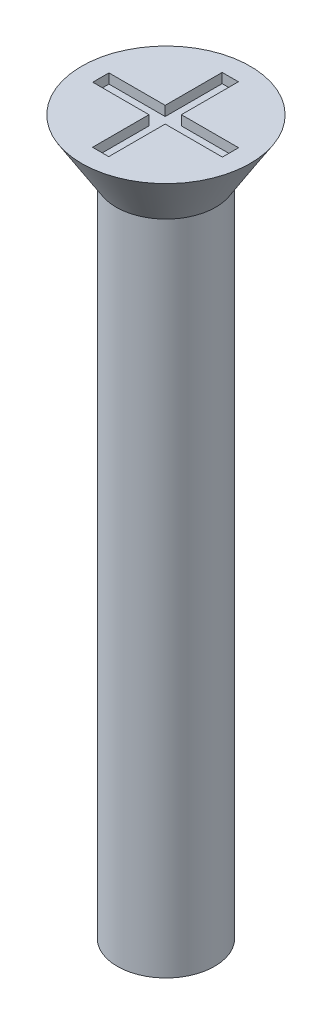
ISO-10303-21;
HEADER;
FILE_DESCRIPTION(('STEP AP214'),'2;1');
FILE_NAME('part.step','',(''),(''),'','','');
FILE_SCHEMA(('AUTOMOTIVE_DESIGN { 1 0 10303 214 1 1 1 1 }'));
ENDSEC;
DATA;
#1=APPLICATION_CONTEXT('core data for automotive mechanical design processes');
#2=APPLICATION_PROTOCOL_DEFINITION('international standard','automotive_design',2000,#1);
#3=PRODUCT_CONTEXT('',#1,'mechanical');
#4=PRODUCT('Part','Part','',(#3));
#5=PRODUCT_RELATED_PRODUCT_CATEGORY('part','',(#4));
#6=PRODUCT_DEFINITION_FORMATION('','',#4);
#7=PRODUCT_DEFINITION_CONTEXT('part definition',#1,'design');
#8=PRODUCT_DEFINITION('design','',#6,#7);
#9=PRODUCT_DEFINITION_SHAPE('','',#8);
#10=(LENGTH_UNIT() NAMED_UNIT(*) SI_UNIT(.MILLI.,.METRE.));
#11=(NAMED_UNIT(*) PLANE_ANGLE_UNIT() SI_UNIT($,.RADIAN.));
#12=(NAMED_UNIT(*) SI_UNIT($,.STERADIAN.) SOLID_ANGLE_UNIT());
#13=UNCERTAINTY_MEASURE_WITH_UNIT(LENGTH_MEASURE(1.E-05),#10,'distance_accuracy_value','');
#14=(GEOMETRIC_REPRESENTATION_CONTEXT(3) GLOBAL_UNCERTAINTY_ASSIGNED_CONTEXT((#13)) GLOBAL_UNIT_ASSIGNED_CONTEXT((#10,
#11,#12)) REPRESENTATION_CONTEXT('',''));
#15=CARTESIAN_POINT('',(0.,0.,0.));
#16=DIRECTION('',(0.,0.,1.));
#17=DIRECTION('',(1.,0.,0.));
#18=AXIS2_PLACEMENT_3D('',#15,#16,#17);
#19=CARTESIAN_POINT('',(0.,22.,0.));
#20=DIRECTION('',(0.,1.,0.));
#21=DIRECTION('',(0.,0.,1.));
#22=AXIS2_PLACEMENT_3D('',#19,#20,#21);
#23=PLANE('',#22);
#24=CARTESIAN_POINT('',(0.,22.,0.));
#25=DIRECTION('',(0.,1.,0.));
#26=DIRECTION('',(0.,0.,1.));
#27=AXIS2_PLACEMENT_3D('',#24,#25,#26);
#28=CIRCLE('',#27,2.6);
#29=CARTESIAN_POINT('',(0.,22.,2.6));
#30=VERTEX_POINT('',#29);
#31=EDGE_CURVE('E192',#30,#30,#28,.T.);
#32=ORIENTED_EDGE('',*,*,#31,.T.);
#33=EDGE_LOOP('',(#32));
#34=FACE_BOUND('',#33,.T.);
#35=DIRECTION('',(1.,0.,0.));
#36=VECTOR('',#35,1.);
#37=CARTESIAN_POINT('',(0.,22.,-2.));
#38=LINE('',#37,#36);
#39=CARTESIAN_POINT('',(-0.265272843023468,22.,-2.));
#40=VERTEX_POINT('',#39);
#41=CARTESIAN_POINT('',(0.234727156976532,22.,-2.));
#42=VERTEX_POINT('',#41);
#43=EDGE_CURVE('E161',#40,#42,#38,.T.);
#44=ORIENTED_EDGE('',*,*,#43,.T.);
#45=DIRECTION('',(0.,0.,1.));
#46=VECTOR('',#45,1.);
#47=CARTESIAN_POINT('',(0.234727156976532,22.,0.));
#48=LINE('',#47,#46);
#49=CARTESIAN_POINT('',(0.234727156976532,22.,-0.241621514992573));
#50=VERTEX_POINT('',#49);
#51=EDGE_CURVE('E48',#42,#50,#48,.T.);
#52=ORIENTED_EDGE('',*,*,#51,.T.);
#53=DIRECTION('',(1.,0.,0.));
#54=VECTOR('',#53,1.);
#55=CARTESIAN_POINT('',(0.,22.,-0.241621514992573));
#56=LINE('',#55,#54);
#57=CARTESIAN_POINT('',(2.,22.,-0.241621514992573));
#58=VERTEX_POINT('',#57);
#59=EDGE_CURVE('E98',#50,#58,#56,.T.);
#60=ORIENTED_EDGE('',*,*,#59,.T.);
#61=DIRECTION('',(0.,0.,1.));
#62=VECTOR('',#61,1.);
#63=CARTESIAN_POINT('',(2.,22.,0.));
#64=LINE('',#63,#62);
#65=CARTESIAN_POINT('',(2.,22.,0.258378485007427));
#66=VERTEX_POINT('',#65);
#67=EDGE_CURVE('E186',#58,#66,#64,.T.);
#68=ORIENTED_EDGE('',*,*,#67,.T.);
#69=DIRECTION('',(1.,0.,0.));
#70=VECTOR('',#69,1.);
#71=CARTESIAN_POINT('',(0.,22.,0.258378485007427));
#72=LINE('',#71,#70);
#73=CARTESIAN_POINT('',(0.234727156976532,22.,0.258378485007427));
#74=VERTEX_POINT('',#73);
#75=EDGE_CURVE('E145',#74,#66,#72,.T.);
#76=ORIENTED_EDGE('',*,*,#75,.F.);
#77=DIRECTION('',(0.,0.,1.));
#78=VECTOR('',#77,1.);
#79=CARTESIAN_POINT('',(0.234727156976532,22.,0.));
#80=LINE('',#79,#78);
#81=CARTESIAN_POINT('',(0.234727156976533,22.,2.));
#82=VERTEX_POINT('',#81);
#83=EDGE_CURVE('E182',#74,#82,#80,.T.);
#84=ORIENTED_EDGE('',*,*,#83,.T.);
#85=DIRECTION('',(1.,0.,0.));
#86=VECTOR('',#85,1.);
#87=CARTESIAN_POINT('',(0.,22.,2.));
#88=LINE('',#87,#86);
#89=CARTESIAN_POINT('',(-0.265272843023467,22.,2.));
#90=VERTEX_POINT('',#89);
#91=EDGE_CURVE('E179',#90,#82,#88,.T.);
#92=ORIENTED_EDGE('',*,*,#91,.F.);
#93=DIRECTION('',(0.,0.,1.));
#94=VECTOR('',#93,1.);
#95=CARTESIAN_POINT('',(-0.265272843023468,22.,0.));
#96=LINE('',#95,#94);
#97=CARTESIAN_POINT('',(-0.265272843023468,22.,0.258378485007427));
#98=VERTEX_POINT('',#97);
#99=EDGE_CURVE('E176',#98,#90,#96,.T.);
#100=ORIENTED_EDGE('',*,*,#99,.F.);
#101=DIRECTION('',(1.,0.,0.));
#102=VECTOR('',#101,1.);
#103=CARTESIAN_POINT('',(0.,22.,0.258378485007427));
#104=LINE('',#103,#102);
#105=CARTESIAN_POINT('',(-2.,22.,0.258378485007427));
#106=VERTEX_POINT('',#105);
#107=EDGE_CURVE('E173',#106,#98,#104,.T.);
#108=ORIENTED_EDGE('',*,*,#107,.F.);
#109=DIRECTION('',(0.,0.,1.));
#110=VECTOR('',#109,1.);
#111=CARTESIAN_POINT('',(-2.,22.,0.));
#112=LINE('',#111,#110);
#113=CARTESIAN_POINT('',(-2.,22.,-0.241621514992573));
#114=VERTEX_POINT('',#113);
#115=EDGE_CURVE('E170',#114,#106,#112,.T.);
#116=ORIENTED_EDGE('',*,*,#115,.F.);
#117=DIRECTION('',(1.,0.,0.));
#118=VECTOR('',#117,1.);
#119=CARTESIAN_POINT('',(0.,22.,-0.241621514992573));
#120=LINE('',#119,#118);
#121=CARTESIAN_POINT('',(-0.265272843023468,22.,-0.241621514992573));
#122=VERTEX_POINT('',#121);
#123=EDGE_CURVE('E167',#114,#122,#120,.T.);
#124=ORIENTED_EDGE('',*,*,#123,.T.);
#125=DIRECTION('',(0.,0.,1.));
#126=VECTOR('',#125,1.);
#127=CARTESIAN_POINT('',(-0.265272843023468,22.,0.));
#128=LINE('',#127,#126);
#129=EDGE_CURVE('E164',#40,#122,#128,.T.);
#130=ORIENTED_EDGE('',*,*,#129,.F.);
#131=EDGE_LOOP('',(#44,#52,#60,#68,#76,#84,#92,#100,#108,#116,#124,#130));
#132=FACE_BOUND('',#131,.T.);
#133=ADVANCED_FACE('F33',(#34,#132),#23,.T.);
#134=CARTESIAN_POINT('',(0.,22.,0.));
#135=DIRECTION('',(0.,-1.,0.));
#136=DIRECTION('',(0.,0.,-1.));
#137=AXIS2_PLACEMENT_3D('',#134,#135,#136);
#138=CYLINDRICAL_SURFACE('',#137,1.5);
#139=CARTESIAN_POINT('',(0.,0.,0.));
#140=DIRECTION('',(0.,1.,0.));
#141=DIRECTION('',(0.,0.,1.));
#142=AXIS2_PLACEMENT_3D('',#139,#140,#141);
#143=CIRCLE('',#142,1.5);
#144=CARTESIAN_POINT('',(0.,0.,1.5));
#145=VERTEX_POINT('',#144);
#146=EDGE_CURVE('E41',#145,#145,#143,.T.);
#147=ORIENTED_EDGE('',*,*,#146,.T.);
#148=EDGE_LOOP('',(#147));
#149=FACE_BOUND('',#148,.T.);
#150=CARTESIAN_POINT('',(0.,20.3,0.));
#151=DIRECTION('',(0.,1.,0.));
#152=DIRECTION('',(0.,0.,1.));
#153=AXIS2_PLACEMENT_3D('',#150,#151,#152);
#154=CIRCLE('',#153,1.5);
#155=CARTESIAN_POINT('',(0.,20.3,1.5));
#156=VERTEX_POINT('',#155);
#157=EDGE_CURVE('E11',#156,#156,#154,.T.);
#158=ORIENTED_EDGE('',*,*,#157,.F.);
#159=EDGE_LOOP('',(#158));
#160=FACE_BOUND('',#159,.T.);
#161=ADVANCED_FACE('F35',(#149,#160),#138,.T.);
#162=CARTESIAN_POINT('',(0.,0.,0.));
#163=DIRECTION('',(0.,1.,0.));
#164=DIRECTION('',(0.,0.,1.));
#165=AXIS2_PLACEMENT_3D('',#162,#163,#164);
#166=PLANE('',#165);
#167=ORIENTED_EDGE('',*,*,#146,.F.);
#168=EDGE_LOOP('',(#167));
#169=FACE_BOUND('',#168,.T.);
#170=ADVANCED_FACE('F219',(#169),#166,.F.);
#171=CARTESIAN_POINT('',(0.,22.,0.));
#172=DIRECTION('',(0.,1.,0.));
#173=DIRECTION('',(0.,0.,1.));
#174=AXIS2_PLACEMENT_3D('',#171,#172,#173);
#175=CONICAL_SURFACE('',#174,2.6,0.558505360638187);
#176=CARTESIAN_POINT('',(0.,20.3,0.));
#177=DIRECTION('',(0.,1.,0.));
#178=DIRECTION('',(0.,0.,1.));
#179=AXIS2_PLACEMENT_3D('',#176,#177,#178);
#180=CIRCLE('',#179,1.53772210175414);
#181=CARTESIAN_POINT('',(0.,20.3,1.53772210175414));
#182=VERTEX_POINT('',#181);
#183=EDGE_CURVE('E212',#182,#182,#180,.T.);
#184=ORIENTED_EDGE('',*,*,#183,.T.);
#185=EDGE_LOOP('',(#184));
#186=FACE_BOUND('',#185,.T.);
#187=ORIENTED_EDGE('',*,*,#31,.F.);
#188=EDGE_LOOP('',(#187));
#189=FACE_BOUND('',#188,.T.);
#190=ADVANCED_FACE('F221',(#186,#189),#175,.T.);
#191=CARTESIAN_POINT('',(0.,20.3,0.));
#192=DIRECTION('',(0.,1.,0.));
#193=DIRECTION('',(0.,0.,1.));
#194=AXIS2_PLACEMENT_3D('',#191,#192,#193);
#195=PLANE('',#194);
#196=ORIENTED_EDGE('',*,*,#157,.T.);
#197=EDGE_LOOP('',(#196));
#198=FACE_BOUND('',#197,.T.);
#199=ORIENTED_EDGE('',*,*,#183,.F.);
#200=EDGE_LOOP('',(#199));
#201=FACE_BOUND('',#200,.T.);
#202=ADVANCED_FACE('F226',(#198,#201),#195,.F.);
#203=CARTESIAN_POINT('',(0.234727156976532,21.7,0.));
#204=DIRECTION('',(-1.,0.,0.));
#205=DIRECTION('',(0.,0.,1.));
#206=AXIS2_PLACEMENT_3D('',#203,#204,#205);
#207=PLANE('',#206);
#208=ORIENTED_EDGE('',*,*,#51,.F.);
#209=DIRECTION('',(0.,1.,0.));
#210=VECTOR('',#209,1.);
#211=CARTESIAN_POINT('',(0.234727156976532,21.7,-2.));
#212=LINE('',#211,#210);
#213=CARTESIAN_POINT('',(0.234727156976532,21.7,-2.));
#214=VERTEX_POINT('',#213);
#215=EDGE_CURVE('E159',#214,#42,#212,.T.);
#216=ORIENTED_EDGE('',*,*,#215,.F.);
#217=DIRECTION('',(0.,0.,1.));
#218=VECTOR('',#217,1.);
#219=CARTESIAN_POINT('',(0.234727156976532,21.7,0.));
#220=LINE('',#219,#218);
#221=CARTESIAN_POINT('',(0.234727156976532,21.7,-0.241621514992573));
#222=VERTEX_POINT('',#221);
#223=EDGE_CURVE('E189',#214,#222,#220,.T.);
#224=ORIENTED_EDGE('',*,*,#223,.T.);
#225=DIRECTION('',(0.,1.,0.));
#226=VECTOR('',#225,1.);
#227=CARTESIAN_POINT('',(0.234727156976532,21.7,-0.241621514992573));
#228=LINE('',#227,#226);
#229=EDGE_CURVE('E190',#222,#50,#228,.T.);
#230=ORIENTED_EDGE('',*,*,#229,.T.);
#231=EDGE_LOOP('',(#208,#216,#224,#230));
#232=FACE_BOUND('',#231,.T.);
#233=ADVANCED_FACE('F238',(#232),#207,.T.);
#234=CARTESIAN_POINT('',(0.,21.7,-0.241621514992573));
#235=DIRECTION('',(0.,0.,1.));
#236=DIRECTION('',(1.,0.,0.));
#237=AXIS2_PLACEMENT_3D('',#234,#235,#236);
#238=PLANE('',#237);
#239=ORIENTED_EDGE('',*,*,#59,.F.);
#240=ORIENTED_EDGE('',*,*,#229,.F.);
#241=DIRECTION('',(1.,0.,0.));
#242=VECTOR('',#241,1.);
#243=CARTESIAN_POINT('',(0.,21.7,-0.241621514992573));
#244=LINE('',#243,#242);
#245=CARTESIAN_POINT('',(2.,21.7,-0.241621514992573));
#246=VERTEX_POINT('',#245);
#247=EDGE_CURVE('E57',#222,#246,#244,.T.);
#248=ORIENTED_EDGE('',*,*,#247,.T.);
#249=DIRECTION('',(0.,1.,0.));
#250=VECTOR('',#249,1.);
#251=CARTESIAN_POINT('',(2.,21.7,-0.241621514992573));
#252=LINE('',#251,#250);
#253=EDGE_CURVE('E137',#246,#58,#252,.T.);
#254=ORIENTED_EDGE('',*,*,#253,.T.);
#255=EDGE_LOOP('',(#239,#240,#248,#254));
#256=FACE_BOUND('',#255,.T.);
#257=ADVANCED_FACE('F242',(#256),#238,.T.);
#258=CARTESIAN_POINT('',(2.,21.7,0.));
#259=DIRECTION('',(-1.,0.,0.));
#260=DIRECTION('',(0.,0.,1.));
#261=AXIS2_PLACEMENT_3D('',#258,#259,#260);
#262=PLANE('',#261);
#263=ORIENTED_EDGE('',*,*,#67,.F.);
#264=ORIENTED_EDGE('',*,*,#253,.F.);
#265=DIRECTION('',(0.,0.,1.));
#266=VECTOR('',#265,1.);
#267=CARTESIAN_POINT('',(2.,21.7,0.));
#268=LINE('',#267,#266);
#269=CARTESIAN_POINT('',(2.,21.7,0.258378485007427));
#270=VERTEX_POINT('',#269);
#271=EDGE_CURVE('E131',#246,#270,#268,.T.);
#272=ORIENTED_EDGE('',*,*,#271,.T.);
#273=DIRECTION('',(0.,1.,0.));
#274=VECTOR('',#273,1.);
#275=CARTESIAN_POINT('',(2.,21.7,0.258378485007427));
#276=LINE('',#275,#274);
#277=EDGE_CURVE('E135',#270,#66,#276,.T.);
#278=ORIENTED_EDGE('',*,*,#277,.T.);
#279=EDGE_LOOP('',(#263,#264,#272,#278));
#280=FACE_BOUND('',#279,.T.);
#281=ADVANCED_FACE('F134',(#280),#262,.T.);
#282=CARTESIAN_POINT('',(0.,21.7,0.258378485007427));
#283=DIRECTION('',(0.,0.,1.));
#284=DIRECTION('',(1.,0.,0.));
#285=AXIS2_PLACEMENT_3D('',#282,#283,#284);
#286=PLANE('',#285);
#287=ORIENTED_EDGE('',*,*,#75,.T.);
#288=ORIENTED_EDGE('',*,*,#277,.F.);
#289=DIRECTION('',(1.,0.,0.));
#290=VECTOR('',#289,1.);
#291=CARTESIAN_POINT('',(0.,21.7,0.258378485007427));
#292=LINE('',#291,#290);
#293=CARTESIAN_POINT('',(0.234727156976532,21.7,0.258378485007427));
#294=VERTEX_POINT('',#293);
#295=EDGE_CURVE('E139',#294,#270,#292,.T.);
#296=ORIENTED_EDGE('',*,*,#295,.F.);
#297=DIRECTION('',(0.,1.,0.));
#298=VECTOR('',#297,1.);
#299=CARTESIAN_POINT('',(0.234727156976532,21.7,0.258378485007427));
#300=LINE('',#299,#298);
#301=EDGE_CURVE('E147',#294,#74,#300,.T.);
#302=ORIENTED_EDGE('',*,*,#301,.T.);
#303=EDGE_LOOP('',(#287,#288,#296,#302));
#304=FACE_BOUND('',#303,.T.);
#305=ADVANCED_FACE('F143',(#304),#286,.F.);
#306=CARTESIAN_POINT('',(0.234727156976532,21.7,0.));
#307=DIRECTION('',(-1.,0.,0.));
#308=DIRECTION('',(0.,0.,1.));
#309=AXIS2_PLACEMENT_3D('',#306,#307,#308);
#310=PLANE('',#309);
#311=ORIENTED_EDGE('',*,*,#83,.F.);
#312=ORIENTED_EDGE('',*,*,#301,.F.);
#313=DIRECTION('',(0.,0.,1.));
#314=VECTOR('',#313,1.);
#315=CARTESIAN_POINT('',(0.234727156976532,21.7,0.));
#316=LINE('',#315,#314);
#317=CARTESIAN_POINT('',(0.234727156976533,21.7,2.));
#318=VERTEX_POINT('',#317);
#319=EDGE_CURVE('E152',#294,#318,#316,.T.);
#320=ORIENTED_EDGE('',*,*,#319,.T.);
#321=DIRECTION('',(0.,1.,0.));
#322=VECTOR('',#321,1.);
#323=CARTESIAN_POINT('',(0.234727156976533,21.7,2.));
#324=LINE('',#323,#322);
#325=EDGE_CURVE('E195',#318,#82,#324,.T.);
#326=ORIENTED_EDGE('',*,*,#325,.T.);
#327=EDGE_LOOP('',(#311,#312,#320,#326));
#328=FACE_BOUND('',#327,.T.);
#329=ADVANCED_FACE('F269',(#328),#310,.T.);
#330=CARTESIAN_POINT('',(0.,21.7,2.));
#331=DIRECTION('',(0.,0.,1.));
#332=DIRECTION('',(1.,0.,0.));
#333=AXIS2_PLACEMENT_3D('',#330,#331,#332);
#334=PLANE('',#333);
#335=ORIENTED_EDGE('',*,*,#91,.T.);
#336=ORIENTED_EDGE('',*,*,#325,.F.);
#337=DIRECTION('',(1.,0.,0.));
#338=VECTOR('',#337,1.);
#339=CARTESIAN_POINT('',(0.,21.7,2.));
#340=LINE('',#339,#338);
#341=CARTESIAN_POINT('',(-0.265272843023467,21.7,2.));
#342=VERTEX_POINT('',#341);
#343=EDGE_CURVE('E154',#342,#318,#340,.T.);
#344=ORIENTED_EDGE('',*,*,#343,.F.);
#345=DIRECTION('',(0.,1.,0.));
#346=VECTOR('',#345,1.);
#347=CARTESIAN_POINT('',(-0.265272843023467,21.7,2.));
#348=LINE('',#347,#346);
#349=EDGE_CURVE('E197',#342,#90,#348,.T.);
#350=ORIENTED_EDGE('',*,*,#349,.T.);
#351=EDGE_LOOP('',(#335,#336,#344,#350));
#352=FACE_BOUND('',#351,.T.);
#353=ADVANCED_FACE('F265',(#352),#334,.F.);
#354=CARTESIAN_POINT('',(-0.265272843023468,21.7,0.));
#355=DIRECTION('',(-1.,0.,0.));
#356=DIRECTION('',(0.,0.,1.));
#357=AXIS2_PLACEMENT_3D('',#354,#355,#356);
#358=PLANE('',#357);
#359=ORIENTED_EDGE('',*,*,#99,.T.);
#360=ORIENTED_EDGE('',*,*,#349,.F.);
#361=DIRECTION('',(0.,0.,1.));
#362=VECTOR('',#361,1.);
#363=CARTESIAN_POINT('',(-0.265272843023468,21.7,0.));
#364=LINE('',#363,#362);
#365=CARTESIAN_POINT('',(-0.265272843023468,21.7,0.258378485007427));
#366=VERTEX_POINT('',#365);
#367=EDGE_CURVE('E417',#366,#342,#364,.T.);
#368=ORIENTED_EDGE('',*,*,#367,.F.);
#369=DIRECTION('',(0.,1.,0.));
#370=VECTOR('',#369,1.);
#371=CARTESIAN_POINT('',(-0.265272843023468,21.7,0.258378485007427));
#372=LINE('',#371,#370);
#373=EDGE_CURVE('E199',#366,#98,#372,.T.);
#374=ORIENTED_EDGE('',*,*,#373,.T.);
#375=EDGE_LOOP('',(#359,#360,#368,#374));
#376=FACE_BOUND('',#375,.T.);
#377=ADVANCED_FACE('F261',(#376),#358,.F.);
#378=CARTESIAN_POINT('',(0.,21.7,0.258378485007427));
#379=DIRECTION('',(0.,0.,1.));
#380=DIRECTION('',(1.,0.,0.));
#381=AXIS2_PLACEMENT_3D('',#378,#379,#380);
#382=PLANE('',#381);
#383=ORIENTED_EDGE('',*,*,#107,.T.);
#384=ORIENTED_EDGE('',*,*,#373,.F.);
#385=DIRECTION('',(1.,0.,0.));
#386=VECTOR('',#385,1.);
#387=CARTESIAN_POINT('',(0.,21.7,0.258378485007427));
#388=LINE('',#387,#386);
#389=CARTESIAN_POINT('',(-2.,21.7,0.258378485007427));
#390=VERTEX_POINT('',#389);
#391=EDGE_CURVE('E414',#390,#366,#388,.T.);
#392=ORIENTED_EDGE('',*,*,#391,.F.);
#393=DIRECTION('',(0.,1.,0.));
#394=VECTOR('',#393,1.);
#395=CARTESIAN_POINT('',(-2.,21.7,0.258378485007427));
#396=LINE('',#395,#394);
#397=EDGE_CURVE('E201',#390,#106,#396,.T.);
#398=ORIENTED_EDGE('',*,*,#397,.T.);
#399=EDGE_LOOP('',(#383,#384,#392,#398));
#400=FACE_BOUND('',#399,.T.);
#401=ADVANCED_FACE('F257',(#400),#382,.F.);
#402=CARTESIAN_POINT('',(-2.,21.7,0.));
#403=DIRECTION('',(-1.,0.,0.));
#404=DIRECTION('',(0.,0.,1.));
#405=AXIS2_PLACEMENT_3D('',#402,#403,#404);
#406=PLANE('',#405);
#407=ORIENTED_EDGE('',*,*,#115,.T.);
#408=ORIENTED_EDGE('',*,*,#397,.F.);
#409=DIRECTION('',(0.,0.,1.));
#410=VECTOR('',#409,1.);
#411=CARTESIAN_POINT('',(-2.,21.7,0.));
#412=LINE('',#411,#410);
#413=CARTESIAN_POINT('',(-2.,21.7,-0.241621514992573));
#414=VERTEX_POINT('',#413);
#415=EDGE_CURVE('E411',#414,#390,#412,.T.);
#416=ORIENTED_EDGE('',*,*,#415,.F.);
#417=DIRECTION('',(0.,1.,0.));
#418=VECTOR('',#417,1.);
#419=CARTESIAN_POINT('',(-2.,21.7,-0.241621514992573));
#420=LINE('',#419,#418);
#421=EDGE_CURVE('E203',#414,#114,#420,.T.);
#422=ORIENTED_EDGE('',*,*,#421,.T.);
#423=EDGE_LOOP('',(#407,#408,#416,#422));
#424=FACE_BOUND('',#423,.T.);
#425=ADVANCED_FACE('F253',(#424),#406,.F.);
#426=CARTESIAN_POINT('',(0.,21.7,-0.241621514992573));
#427=DIRECTION('',(0.,0.,1.));
#428=DIRECTION('',(1.,0.,0.));
#429=AXIS2_PLACEMENT_3D('',#426,#427,#428);
#430=PLANE('',#429);
#431=ORIENTED_EDGE('',*,*,#123,.F.);
#432=ORIENTED_EDGE('',*,*,#421,.F.);
#433=DIRECTION('',(1.,0.,0.));
#434=VECTOR('',#433,1.);
#435=CARTESIAN_POINT('',(0.,21.7,-0.241621514992573));
#436=LINE('',#435,#434);
#437=CARTESIAN_POINT('',(-0.265272843023468,21.7,-0.241621514992573));
#438=VERTEX_POINT('',#437);
#439=EDGE_CURVE('E409',#414,#438,#436,.T.);
#440=ORIENTED_EDGE('',*,*,#439,.T.);
#441=DIRECTION('',(0.,1.,0.));
#442=VECTOR('',#441,1.);
#443=CARTESIAN_POINT('',(-0.265272843023468,21.7,-0.241621514992573));
#444=LINE('',#443,#442);
#445=EDGE_CURVE('E205',#438,#122,#444,.T.);
#446=ORIENTED_EDGE('',*,*,#445,.T.);
#447=EDGE_LOOP('',(#431,#432,#440,#446));
#448=FACE_BOUND('',#447,.T.);
#449=ADVANCED_FACE('F249',(#448),#430,.T.);
#450=CARTESIAN_POINT('',(-0.265272843023468,21.7,0.));
#451=DIRECTION('',(-1.,0.,0.));
#452=DIRECTION('',(0.,0.,1.));
#453=AXIS2_PLACEMENT_3D('',#450,#451,#452);
#454=PLANE('',#453);
#455=ORIENTED_EDGE('',*,*,#129,.T.);
#456=ORIENTED_EDGE('',*,*,#445,.F.);
#457=DIRECTION('',(0.,0.,1.));
#458=VECTOR('',#457,1.);
#459=CARTESIAN_POINT('',(-0.265272843023468,21.7,0.));
#460=LINE('',#459,#458);
#461=CARTESIAN_POINT('',(-0.265272843023468,21.7,-2.));
#462=VERTEX_POINT('',#461);
#463=EDGE_CURVE('E405',#462,#438,#460,.T.);
#464=ORIENTED_EDGE('',*,*,#463,.F.);
#465=DIRECTION('',(0.,1.,0.));
#466=VECTOR('',#465,1.);
#467=CARTESIAN_POINT('',(-0.265272843023468,21.7,-2.));
#468=LINE('',#467,#466);
#469=EDGE_CURVE('E207',#462,#40,#468,.T.);
#470=ORIENTED_EDGE('',*,*,#469,.T.);
#471=EDGE_LOOP('',(#455,#456,#464,#470));
#472=FACE_BOUND('',#471,.T.);
#473=ADVANCED_FACE('F246',(#472),#454,.F.);
#474=CARTESIAN_POINT('',(0.,21.7,-2.));
#475=DIRECTION('',(0.,0.,1.));
#476=DIRECTION('',(1.,0.,0.));
#477=AXIS2_PLACEMENT_3D('',#474,#475,#476);
#478=PLANE('',#477);
#479=ORIENTED_EDGE('',*,*,#43,.F.);
#480=ORIENTED_EDGE('',*,*,#469,.F.);
#481=DIRECTION('',(1.,0.,0.));
#482=VECTOR('',#481,1.);
#483=CARTESIAN_POINT('',(0.,21.7,-2.));
#484=LINE('',#483,#482);
#485=EDGE_CURVE('E105',#462,#214,#484,.T.);
#486=ORIENTED_EDGE('',*,*,#485,.T.);
#487=ORIENTED_EDGE('',*,*,#215,.T.);
#488=EDGE_LOOP('',(#479,#480,#486,#487));
#489=FACE_BOUND('',#488,.T.);
#490=ADVANCED_FACE('F243',(#489),#478,.T.);
#491=CARTESIAN_POINT('',(0.,21.7,0.));
#492=DIRECTION('',(0.,1.,0.));
#493=DIRECTION('',(0.,0.,1.));
#494=AXIS2_PLACEMENT_3D('',#491,#492,#493);
#495=PLANE('',#494);
#496=ORIENTED_EDGE('',*,*,#223,.F.);
#497=ORIENTED_EDGE('',*,*,#485,.F.);
#498=ORIENTED_EDGE('',*,*,#463,.T.);
#499=ORIENTED_EDGE('',*,*,#439,.F.);
#500=ORIENTED_EDGE('',*,*,#415,.T.);
#501=ORIENTED_EDGE('',*,*,#391,.T.);
#502=ORIENTED_EDGE('',*,*,#367,.T.);
#503=ORIENTED_EDGE('',*,*,#343,.T.);
#504=ORIENTED_EDGE('',*,*,#319,.F.);
#505=ORIENTED_EDGE('',*,*,#295,.T.);
#506=ORIENTED_EDGE('',*,*,#271,.F.);
#507=ORIENTED_EDGE('',*,*,#247,.F.);
#508=EDGE_LOOP('',(#496,#497,#498,#499,#500,#501,#502,#503,#504,#505,#506,#507));
#509=FACE_BOUND('',#508,.T.);
#510=ADVANCED_FACE('F150',(#509),#495,.T.);
#511=CLOSED_SHELL('',(#133,#161,#170,#190,#202,#233,#257,#281,#305,#329,#353,#377,#401,#425,
#449,#473,#490,#510));
#512=MANIFOLD_SOLID_BREP('B2',#511);
#513=ADVANCED_BREP_SHAPE_REPRESENTATION('',(#18,#512),#14);
#514=SHAPE_DEFINITION_REPRESENTATION(#9,#513);
ENDSEC;
END-ISO-10303-21;
